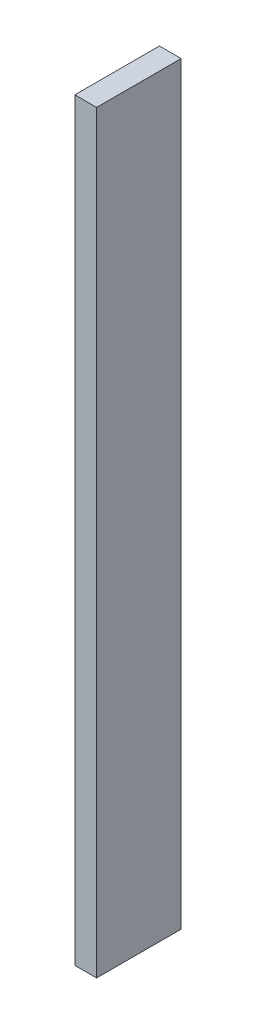
ISO-10303-21;
HEADER;
FILE_DESCRIPTION(('STEP AP214'),'2;1');
FILE_NAME('part.step','',(''),(''),'','','');
FILE_SCHEMA(('AUTOMOTIVE_DESIGN { 1 0 10303 214 1 1 1 1 }'));
ENDSEC;
DATA;
#1=APPLICATION_CONTEXT('core data for automotive mechanical design processes');
#2=APPLICATION_PROTOCOL_DEFINITION('international standard','automotive_design',2000,#1);
#3=PRODUCT_CONTEXT('',#1,'mechanical');
#4=PRODUCT('Part','Part','',(#3));
#5=PRODUCT_RELATED_PRODUCT_CATEGORY('part','',(#4));
#6=PRODUCT_DEFINITION_FORMATION('','',#4);
#7=PRODUCT_DEFINITION_CONTEXT('part definition',#1,'design');
#8=PRODUCT_DEFINITION('design','',#6,#7);
#9=PRODUCT_DEFINITION_SHAPE('','',#8);
#10=(LENGTH_UNIT() NAMED_UNIT(*) SI_UNIT(.MILLI.,.METRE.));
#11=(NAMED_UNIT(*) PLANE_ANGLE_UNIT() SI_UNIT($,.RADIAN.));
#12=(NAMED_UNIT(*) SI_UNIT($,.STERADIAN.) SOLID_ANGLE_UNIT());
#13=UNCERTAINTY_MEASURE_WITH_UNIT(LENGTH_MEASURE(1.E-05),#10,'distance_accuracy_value','');
#14=(GEOMETRIC_REPRESENTATION_CONTEXT(3) GLOBAL_UNCERTAINTY_ASSIGNED_CONTEXT((#13)) GLOBAL_UNIT_ASSIGNED_CONTEXT((#10,
#11,#12)) REPRESENTATION_CONTEXT('',''));
#15=CARTESIAN_POINT('',(0.,0.,0.));
#16=DIRECTION('',(0.,0.,1.));
#17=DIRECTION('',(1.,0.,0.));
#18=AXIS2_PLACEMENT_3D('',#15,#16,#17);
#19=CARTESIAN_POINT('',(-57.8500000000028,156.,35.));
#20=DIRECTION('',(0.,-1.,0.));
#21=DIRECTION('',(1.,0.,0.));
#22=AXIS2_PLACEMENT_3D('',#19,#20,#21);
#23=PLANE('',#22);
#24=DIRECTION('',(-1.,0.,0.));
#25=VECTOR('',#24,1.);
#26=CARTESIAN_POINT('',(-57.8500000000028,156.,0.));
#27=LINE('',#26,#25);
#28=CARTESIAN_POINT('',(-57.8500000000028,156.,0.));
#29=VERTEX_POINT('',#28);
#30=CARTESIAN_POINT('',(-66.8500000000028,156.,0.));
#31=VERTEX_POINT('',#30);
#32=EDGE_CURVE('E97',#29,#31,#27,.T.);
#33=ORIENTED_EDGE('',*,*,#32,.T.);
#34=DIRECTION('',(0.,0.,-1.));
#35=VECTOR('',#34,1.);
#36=CARTESIAN_POINT('',(-66.8500000000028,156.,35.));
#37=LINE('',#36,#35);
#38=CARTESIAN_POINT('',(-66.8500000000028,156.,35.));
#39=VERTEX_POINT('',#38);
#40=EDGE_CURVE('E11',#39,#31,#37,.T.);
#41=ORIENTED_EDGE('',*,*,#40,.F.);
#42=DIRECTION('',(-1.,0.,0.));
#43=VECTOR('',#42,1.);
#44=CARTESIAN_POINT('',(-57.8500000000028,156.,35.));
#45=LINE('',#44,#43);
#46=CARTESIAN_POINT('',(-57.8500000000028,156.,35.));
#47=VERTEX_POINT('',#46);
#48=EDGE_CURVE('E83',#47,#39,#45,.T.);
#49=ORIENTED_EDGE('',*,*,#48,.F.);
#50=DIRECTION('',(0.,0.,-1.));
#51=VECTOR('',#50,1.);
#52=CARTESIAN_POINT('',(-57.8500000000028,156.,35.));
#53=LINE('',#52,#51);
#54=EDGE_CURVE('E50',#47,#29,#53,.T.);
#55=ORIENTED_EDGE('',*,*,#54,.T.);
#56=EDGE_LOOP('',(#33,#41,#49,#55));
#57=FACE_BOUND('',#56,.T.);
#58=ADVANCED_FACE('F34',(#57),#23,.F.);
#59=CARTESIAN_POINT('',(-66.8500000000028,156.,35.));
#60=DIRECTION('',(1.,0.,0.));
#61=DIRECTION('',(0.,1.,0.));
#62=AXIS2_PLACEMENT_3D('',#59,#60,#61);
#63=PLANE('',#62);
#64=DIRECTION('',(0.,-1.,0.));
#65=VECTOR('',#64,1.);
#66=CARTESIAN_POINT('',(-66.8500000000028,156.,0.));
#67=LINE('',#66,#65);
#68=CARTESIAN_POINT('',(-66.8500000000028,-156.,0.));
#69=VERTEX_POINT('',#68);
#70=EDGE_CURVE('E88',#31,#69,#67,.T.);
#71=ORIENTED_EDGE('',*,*,#70,.T.);
#72=DIRECTION('',(0.,0.,-1.));
#73=VECTOR('',#72,1.);
#74=CARTESIAN_POINT('',(-66.8500000000028,-156.,35.));
#75=LINE('',#74,#73);
#76=CARTESIAN_POINT('',(-66.8500000000028,-156.,35.));
#77=VERTEX_POINT('',#76);
#78=EDGE_CURVE('E42',#77,#69,#75,.T.);
#79=ORIENTED_EDGE('',*,*,#78,.F.);
#80=DIRECTION('',(0.,-1.,0.));
#81=VECTOR('',#80,1.);
#82=CARTESIAN_POINT('',(-66.8500000000028,156.,35.));
#83=LINE('',#82,#81);
#84=EDGE_CURVE('E75',#39,#77,#83,.T.);
#85=ORIENTED_EDGE('',*,*,#84,.F.);
#86=ORIENTED_EDGE('',*,*,#40,.T.);
#87=EDGE_LOOP('',(#71,#79,#85,#86));
#88=FACE_BOUND('',#87,.T.);
#89=ADVANCED_FACE('F87',(#88),#63,.F.);
#90=CARTESIAN_POINT('',(-57.8500000000027,-156.,35.));
#91=DIRECTION('',(0.,-1.,0.));
#92=DIRECTION('',(1.,0.,0.));
#93=AXIS2_PLACEMENT_3D('',#90,#91,#92);
#94=PLANE('',#93);
#95=DIRECTION('',(-1.,0.,0.));
#96=VECTOR('',#95,1.);
#97=CARTESIAN_POINT('',(-57.8500000000027,-156.,0.));
#98=LINE('',#97,#96);
#99=CARTESIAN_POINT('',(-57.8500000000027,-156.,0.));
#100=VERTEX_POINT('',#99);
#101=EDGE_CURVE('E100',#100,#69,#98,.T.);
#102=ORIENTED_EDGE('',*,*,#101,.F.);
#103=DIRECTION('',(0.,0.,-1.));
#104=VECTOR('',#103,1.);
#105=CARTESIAN_POINT('',(-57.8500000000027,-156.,35.));
#106=LINE('',#105,#104);
#107=CARTESIAN_POINT('',(-57.8500000000027,-156.,35.));
#108=VERTEX_POINT('',#107);
#109=EDGE_CURVE('E64',#108,#100,#106,.T.);
#110=ORIENTED_EDGE('',*,*,#109,.F.);
#111=DIRECTION('',(-1.,0.,0.));
#112=VECTOR('',#111,1.);
#113=CARTESIAN_POINT('',(-57.8500000000027,-156.,35.));
#114=LINE('',#113,#112);
#115=EDGE_CURVE('E82',#108,#77,#114,.T.);
#116=ORIENTED_EDGE('',*,*,#115,.T.);
#117=ORIENTED_EDGE('',*,*,#78,.T.);
#118=EDGE_LOOP('',(#102,#110,#116,#117));
#119=FACE_BOUND('',#118,.T.);
#120=ADVANCED_FACE('F91',(#119),#94,.T.);
#121=CARTESIAN_POINT('',(-57.8500000000028,156.,35.));
#122=DIRECTION('',(1.,0.,0.));
#123=DIRECTION('',(0.,1.,0.));
#124=AXIS2_PLACEMENT_3D('',#121,#122,#123);
#125=PLANE('',#124);
#126=DIRECTION('',(0.,-1.,0.));
#127=VECTOR('',#126,1.);
#128=CARTESIAN_POINT('',(-57.8500000000028,156.,0.));
#129=LINE('',#128,#127);
#130=EDGE_CURVE('E102',#29,#100,#129,.T.);
#131=ORIENTED_EDGE('',*,*,#130,.F.);
#132=ORIENTED_EDGE('',*,*,#54,.F.);
#133=DIRECTION('',(0.,-1.,0.));
#134=VECTOR('',#133,1.);
#135=CARTESIAN_POINT('',(-57.8500000000028,156.,35.));
#136=LINE('',#135,#134);
#137=EDGE_CURVE('E92',#47,#108,#136,.T.);
#138=ORIENTED_EDGE('',*,*,#137,.T.);
#139=ORIENTED_EDGE('',*,*,#109,.T.);
#140=EDGE_LOOP('',(#131,#132,#138,#139));
#141=FACE_BOUND('',#140,.T.);
#142=ADVANCED_FACE('F108',(#141),#125,.T.);
#143=CARTESIAN_POINT('',(0.,0.,35.));
#144=DIRECTION('',(0.,0.,1.));
#145=DIRECTION('',(1.,0.,0.));
#146=AXIS2_PLACEMENT_3D('',#143,#144,#145);
#147=PLANE('',#146);
#148=ORIENTED_EDGE('',*,*,#48,.T.);
#149=ORIENTED_EDGE('',*,*,#84,.T.);
#150=ORIENTED_EDGE('',*,*,#115,.F.);
#151=ORIENTED_EDGE('',*,*,#137,.F.);
#152=EDGE_LOOP('',(#148,#149,#150,#151));
#153=FACE_BOUND('',#152,.T.);
#154=ADVANCED_FACE('F79',(#153),#147,.T.);
#155=CARTESIAN_POINT('',(0.,0.,0.));
#156=DIRECTION('',(0.,0.,1.));
#157=DIRECTION('',(1.,0.,0.));
#158=AXIS2_PLACEMENT_3D('',#155,#156,#157);
#159=PLANE('',#158);
#160=ORIENTED_EDGE('',*,*,#32,.F.);
#161=ORIENTED_EDGE('',*,*,#130,.T.);
#162=ORIENTED_EDGE('',*,*,#101,.T.);
#163=ORIENTED_EDGE('',*,*,#70,.F.);
#164=EDGE_LOOP('',(#160,#161,#162,#163));
#165=FACE_BOUND('',#164,.T.);
#166=ADVANCED_FACE('F107',(#165),#159,.F.);
#167=CLOSED_SHELL('',(#58,#89,#120,#142,#154,#166));
#168=MANIFOLD_SOLID_BREP('B2',#167);
#169=ADVANCED_BREP_SHAPE_REPRESENTATION('',(#18,#168),#14);
#170=SHAPE_DEFINITION_REPRESENTATION(#9,#169);
ENDSEC;
END-ISO-10303-21;
